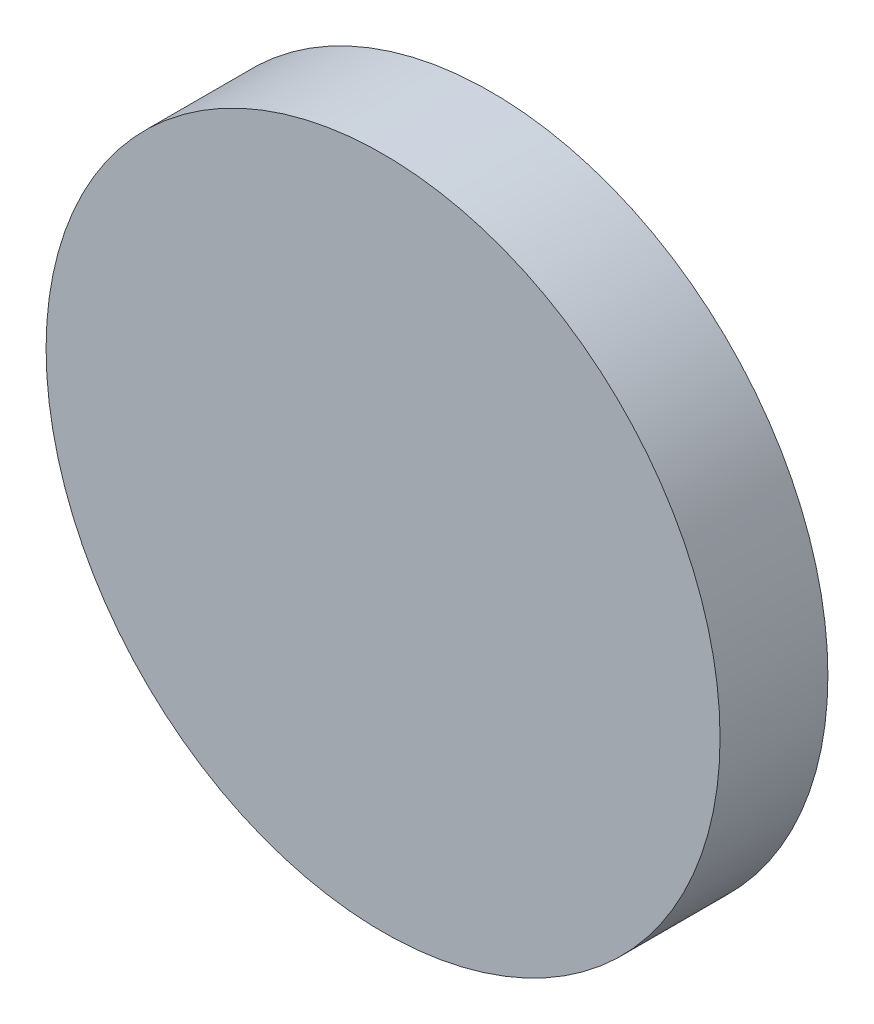
ISO-10303-21;
HEADER;
FILE_DESCRIPTION(('STEP AP214'),'2;1');
FILE_NAME('part.step','',(''),(''),'','','');
FILE_SCHEMA(('AUTOMOTIVE_DESIGN { 1 0 10303 214 1 1 1 1 }'));
ENDSEC;
DATA;
#1=APPLICATION_CONTEXT('core data for automotive mechanical design processes');
#2=APPLICATION_PROTOCOL_DEFINITION('international standard','automotive_design',2000,#1);
#3=PRODUCT_CONTEXT('',#1,'mechanical');
#4=PRODUCT('Part','Part','',(#3));
#5=PRODUCT_RELATED_PRODUCT_CATEGORY('part','',(#4));
#6=PRODUCT_DEFINITION_FORMATION('','',#4);
#7=PRODUCT_DEFINITION_CONTEXT('part definition',#1,'design');
#8=PRODUCT_DEFINITION('design','',#6,#7);
#9=PRODUCT_DEFINITION_SHAPE('','',#8);
#10=(LENGTH_UNIT() NAMED_UNIT(*) SI_UNIT(.MILLI.,.METRE.));
#11=(NAMED_UNIT(*) PLANE_ANGLE_UNIT() SI_UNIT($,.RADIAN.));
#12=(NAMED_UNIT(*) SI_UNIT($,.STERADIAN.) SOLID_ANGLE_UNIT());
#13=UNCERTAINTY_MEASURE_WITH_UNIT(LENGTH_MEASURE(1.E-05),#10,'distance_accuracy_value','');
#14=(GEOMETRIC_REPRESENTATION_CONTEXT(3) GLOBAL_UNCERTAINTY_ASSIGNED_CONTEXT((#13)) GLOBAL_UNIT_ASSIGNED_CONTEXT((#10,
#11,#12)) REPRESENTATION_CONTEXT('',''));
#15=CARTESIAN_POINT('',(0.,0.,0.));
#16=DIRECTION('',(0.,0.,1.));
#17=DIRECTION('',(1.,0.,0.));
#18=AXIS2_PLACEMENT_3D('',#15,#16,#17);
#19=CARTESIAN_POINT('',(0.,0.,4.));
#20=DIRECTION('',(0.,0.,-1.));
#21=DIRECTION('',(-1.,0.,0.));
#22=AXIS2_PLACEMENT_3D('',#19,#20,#21);
#23=CYLINDRICAL_SURFACE('',#22,12.5);
#24=CARTESIAN_POINT('',(0.,0.,4.));
#25=DIRECTION('',(0.,0.,1.));
#26=DIRECTION('',(1.,0.,0.));
#27=AXIS2_PLACEMENT_3D('',#24,#25,#26);
#28=CIRCLE('',#27,12.5);
#29=CARTESIAN_POINT('',(12.5,0.,4.));
#30=VERTEX_POINT('',#29);
#31=EDGE_CURVE('E10',#30,#30,#28,.T.);
#32=ORIENTED_EDGE('',*,*,#31,.F.);
#33=EDGE_LOOP('',(#32));
#34=FACE_BOUND('',#33,.T.);
#35=CARTESIAN_POINT('',(0.,0.,0.));
#36=DIRECTION('',(0.,0.,1.));
#37=DIRECTION('',(1.,0.,0.));
#38=AXIS2_PLACEMENT_3D('',#35,#36,#37);
#39=CIRCLE('',#38,12.5);
#40=CARTESIAN_POINT('',(12.5,0.,0.));
#41=VERTEX_POINT('',#40);
#42=EDGE_CURVE('E40',#41,#41,#39,.T.);
#43=ORIENTED_EDGE('',*,*,#42,.T.);
#44=EDGE_LOOP('',(#43));
#45=FACE_BOUND('',#44,.T.);
#46=ADVANCED_FACE('F37',(#34,#45),#23,.T.);
#47=CARTESIAN_POINT('',(0.,0.,4.));
#48=DIRECTION('',(0.,0.,1.));
#49=DIRECTION('',(1.,0.,0.));
#50=AXIS2_PLACEMENT_3D('',#47,#48,#49);
#51=PLANE('',#50);
#52=ORIENTED_EDGE('',*,*,#31,.T.);
#53=EDGE_LOOP('',(#52));
#54=FACE_BOUND('',#53,.T.);
#55=ADVANCED_FACE('F54',(#54),#51,.T.);
#56=CARTESIAN_POINT('',(0.,0.,0.));
#57=DIRECTION('',(0.,0.,1.));
#58=DIRECTION('',(1.,0.,0.));
#59=AXIS2_PLACEMENT_3D('',#56,#57,#58);
#60=PLANE('',#59);
#61=ORIENTED_EDGE('',*,*,#42,.F.);
#62=EDGE_LOOP('',(#61));
#63=FACE_BOUND('',#62,.T.);
#64=ADVANCED_FACE('F52',(#63),#60,.F.);
#65=CLOSED_SHELL('',(#46,#55,#64));
#66=MANIFOLD_SOLID_BREP('B2',#65);
#67=ADVANCED_BREP_SHAPE_REPRESENTATION('',(#18,#66),#14);
#68=SHAPE_DEFINITION_REPRESENTATION(#9,#67);
ENDSEC;
END-ISO-10303-21;
